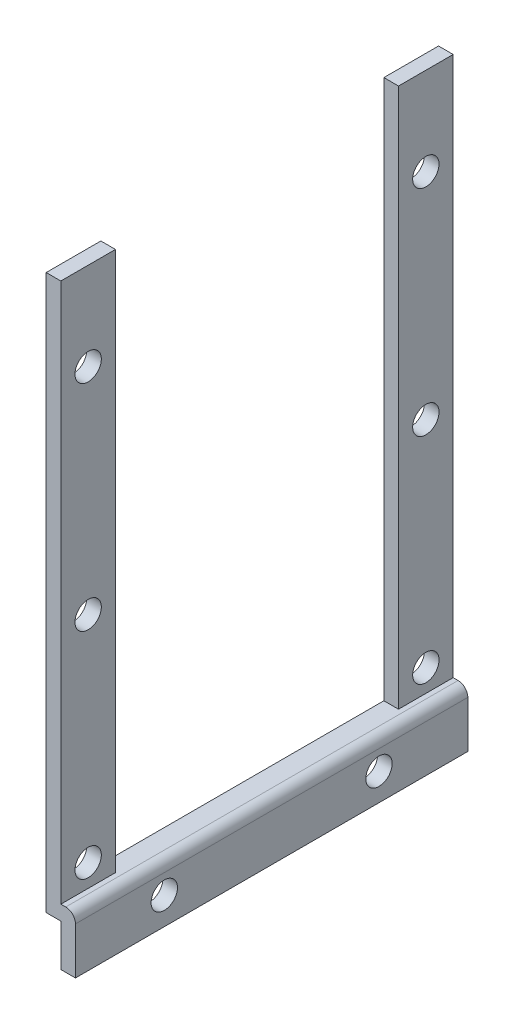
ISO-10303-21;
HEADER;
FILE_DESCRIPTION(('STEP AP214'),'2;1');
FILE_NAME('part.step','',(''),(''),'','','');
FILE_SCHEMA(('AUTOMOTIVE_DESIGN { 1 0 10303 214 1 1 1 1 }'));
ENDSEC;
DATA;
#1=APPLICATION_CONTEXT('core data for automotive mechanical design processes');
#2=APPLICATION_PROTOCOL_DEFINITION('international standard','automotive_design',2000,#1);
#3=PRODUCT_CONTEXT('',#1,'mechanical');
#4=PRODUCT('Part','Part','',(#3));
#5=PRODUCT_RELATED_PRODUCT_CATEGORY('part','',(#4));
#6=PRODUCT_DEFINITION_FORMATION('','',#4);
#7=PRODUCT_DEFINITION_CONTEXT('part definition',#1,'design');
#8=PRODUCT_DEFINITION('design','',#6,#7);
#9=PRODUCT_DEFINITION_SHAPE('','',#8);
#10=(LENGTH_UNIT() NAMED_UNIT(*) SI_UNIT(.MILLI.,.METRE.));
#11=(NAMED_UNIT(*) PLANE_ANGLE_UNIT() SI_UNIT($,.RADIAN.));
#12=(NAMED_UNIT(*) SI_UNIT($,.STERADIAN.) SOLID_ANGLE_UNIT());
#13=UNCERTAINTY_MEASURE_WITH_UNIT(LENGTH_MEASURE(1.E-05),#10,'distance_accuracy_value','');
#14=(GEOMETRIC_REPRESENTATION_CONTEXT(3) GLOBAL_UNCERTAINTY_ASSIGNED_CONTEXT((#13)) GLOBAL_UNIT_ASSIGNED_CONTEXT((#10,
#11,#12)) REPRESENTATION_CONTEXT('',''));
#15=CARTESIAN_POINT('',(0.,0.,0.));
#16=DIRECTION('',(0.,0.,1.));
#17=DIRECTION('',(1.,0.,0.));
#18=AXIS2_PLACEMENT_3D('',#15,#16,#17);
#19=CARTESIAN_POINT('',(-1.5,61.1,-40.2));
#20=DIRECTION('',(0.,1.,0.));
#21=DIRECTION('',(0.,0.,1.));
#22=AXIS2_PLACEMENT_3D('',#19,#20,#21);
#23=PLANE('',#22);
#24=DIRECTION('',(1.,0.,0.));
#25=VECTOR('',#24,1.);
#26=CARTESIAN_POINT('',(-1.50100000000001,61.1,-5.59999999999999));
#27=LINE('',#26,#25);
#28=CARTESIAN_POINT('',(-1.5,61.1,-5.59999999999999));
#29=VERTEX_POINT('',#28);
#30=CARTESIAN_POINT('',(0.,61.1,-5.59999999999999));
#31=VERTEX_POINT('',#30);
#32=EDGE_CURVE('E137',#29,#31,#27,.T.);
#33=ORIENTED_EDGE('',*,*,#32,.F.);
#34=DIRECTION('',(0.,0.,1.));
#35=VECTOR('',#34,1.);
#36=CARTESIAN_POINT('',(-1.5,61.1,-40.2));
#37=LINE('',#36,#35);
#38=CARTESIAN_POINT('',(-1.5,61.1,0.));
#39=VERTEX_POINT('',#38);
#40=EDGE_CURVE('E156',#29,#39,#37,.T.);
#41=ORIENTED_EDGE('',*,*,#40,.T.);
#42=DIRECTION('',(-1.,0.,0.));
#43=VECTOR('',#42,1.);
#44=CARTESIAN_POINT('',(-1.5,61.1,0.));
#45=LINE('',#44,#43);
#46=CARTESIAN_POINT('',(0.,61.1,0.));
#47=VERTEX_POINT('',#46);
#48=EDGE_CURVE('E196',#47,#39,#45,.T.);
#49=ORIENTED_EDGE('',*,*,#48,.F.);
#50=DIRECTION('',(0.,0.,1.));
#51=VECTOR('',#50,1.);
#52=CARTESIAN_POINT('',(0.,61.1,-40.2));
#53=LINE('',#52,#51);
#54=EDGE_CURVE('E164',#31,#47,#53,.T.);
#55=ORIENTED_EDGE('',*,*,#54,.F.);
#56=EDGE_LOOP('',(#33,#41,#49,#55));
#57=FACE_BOUND('',#56,.T.);
#58=ADVANCED_FACE('F35',(#57),#23,.T.);
#59=CARTESIAN_POINT('',(0.,61.1,-40.2));
#60=DIRECTION('',(1.,0.,0.));
#61=DIRECTION('',(0.,1.,0.));
#62=AXIS2_PLACEMENT_3D('',#59,#60,#61);
#63=PLANE('',#62);
#64=CARTESIAN_POINT('',(0.,52.1,-2.79999999999999));
#65=DIRECTION('',(1.,0.,0.));
#66=DIRECTION('',(0.,1.,0.));
#67=AXIS2_PLACEMENT_3D('',#64,#65,#66);
#68=CIRCLE('',#67,1.35);
#69=CARTESIAN_POINT('',(0.,53.45,-2.79999999999999));
#70=VERTEX_POINT('',#69);
#71=EDGE_CURVE('E256',#70,#70,#68,.T.);
#72=ORIENTED_EDGE('',*,*,#71,.F.);
#73=EDGE_LOOP('',(#72));
#74=FACE_BOUND('',#73,.T.);
#75=CARTESIAN_POINT('',(0.,30.1,-2.8));
#76=DIRECTION('',(1.,0.,0.));
#77=DIRECTION('',(0.,1.,0.));
#78=AXIS2_PLACEMENT_3D('',#75,#76,#77);
#79=CIRCLE('',#78,1.35);
#80=CARTESIAN_POINT('',(0.,31.45,-2.8));
#81=VERTEX_POINT('',#80);
#82=EDGE_CURVE('E244',#81,#81,#79,.T.);
#83=ORIENTED_EDGE('',*,*,#82,.F.);
#84=EDGE_LOOP('',(#83));
#85=FACE_BOUND('',#84,.T.);
#86=CARTESIAN_POINT('',(0.,8.1,-2.8));
#87=DIRECTION('',(1.,0.,0.));
#88=DIRECTION('',(0.,1.,0.));
#89=AXIS2_PLACEMENT_3D('',#86,#87,#88);
#90=CIRCLE('',#89,1.35);
#91=CARTESIAN_POINT('',(0.,9.45,-2.8));
#92=VERTEX_POINT('',#91);
#93=EDGE_CURVE('E149',#92,#92,#90,.T.);
#94=ORIENTED_EDGE('',*,*,#93,.F.);
#95=EDGE_LOOP('',(#94));
#96=FACE_BOUND('',#95,.T.);
#97=DIRECTION('',(0.,-1.,0.));
#98=VECTOR('',#97,1.);
#99=CARTESIAN_POINT('',(0.,61.1,-5.59999999999999));
#100=LINE('',#99,#98);
#101=CARTESIAN_POINT('',(0.,5.8,-5.59999999999999));
#102=VERTEX_POINT('',#101);
#103=EDGE_CURVE('E232',#31,#102,#100,.T.);
#104=ORIENTED_EDGE('',*,*,#103,.F.);
#105=ORIENTED_EDGE('',*,*,#54,.T.);
#106=DIRECTION('',(0.,1.,0.));
#107=VECTOR('',#106,1.);
#108=CARTESIAN_POINT('',(0.,61.1,0.));
#109=LINE('',#108,#107);
#110=CARTESIAN_POINT('',(0.,5.8,0.));
#111=VERTEX_POINT('',#110);
#112=EDGE_CURVE('E199',#111,#47,#109,.T.);
#113=ORIENTED_EDGE('',*,*,#112,.F.);
#114=DIRECTION('',(0.,0.,1.));
#115=VECTOR('',#114,1.);
#116=CARTESIAN_POINT('',(0.,5.8,-40.2));
#117=LINE('',#116,#115);
#118=EDGE_CURVE('E168',#102,#111,#117,.T.);
#119=ORIENTED_EDGE('',*,*,#118,.F.);
#120=EDGE_LOOP('',(#104,#105,#113,#119));
#121=FACE_BOUND('',#120,.T.);
#122=ADVANCED_FACE('F321',(#74,#85,#96,#121),#63,.T.);
#123=CARTESIAN_POINT('',(1.5,0.,-40.2));
#124=DIRECTION('',(0.,-1.,0.));
#125=DIRECTION('',(1.,0.,0.));
#126=AXIS2_PLACEMENT_3D('',#123,#124,#125);
#127=PLANE('',#126);
#128=DIRECTION('',(1.,0.,0.));
#129=VECTOR('',#128,1.);
#130=CARTESIAN_POINT('',(1.5,0.,0.));
#131=LINE('',#130,#129);
#132=CARTESIAN_POINT('',(0.,0.,0.));
#133=VERTEX_POINT('',#132);
#134=CARTESIAN_POINT('',(1.5,0.,0.));
#135=VERTEX_POINT('',#134);
#136=EDGE_CURVE('E206',#133,#135,#131,.T.);
#137=ORIENTED_EDGE('',*,*,#136,.F.);
#138=DIRECTION('',(0.,0.,1.));
#139=VECTOR('',#138,1.);
#140=CARTESIAN_POINT('',(0.,0.,-40.2));
#141=LINE('',#140,#139);
#142=CARTESIAN_POINT('',(0.,0.,-40.2));
#143=VERTEX_POINT('',#142);
#144=EDGE_CURVE('E175',#143,#133,#141,.T.);
#145=ORIENTED_EDGE('',*,*,#144,.F.);
#146=DIRECTION('',(1.,0.,0.));
#147=VECTOR('',#146,1.);
#148=CARTESIAN_POINT('',(1.5,0.,-40.2));
#149=LINE('',#148,#147);
#150=CARTESIAN_POINT('',(1.5,0.,-40.2));
#151=VERTEX_POINT('',#150);
#152=EDGE_CURVE('E189',#143,#151,#149,.T.);
#153=ORIENTED_EDGE('',*,*,#152,.T.);
#154=DIRECTION('',(0.,0.,1.));
#155=VECTOR('',#154,1.);
#156=CARTESIAN_POINT('',(1.5,0.,-40.2));
#157=LINE('',#156,#155);
#158=EDGE_CURVE('E169',#151,#135,#157,.T.);
#159=ORIENTED_EDGE('',*,*,#158,.T.);
#160=EDGE_LOOP('',(#137,#145,#153,#159));
#161=FACE_BOUND('',#160,.T.);
#162=ADVANCED_FACE('F323',(#161),#127,.T.);
#163=CARTESIAN_POINT('',(0.,0.,-40.2));
#164=DIRECTION('',(-1.,0.,0.));
#165=DIRECTION('',(0.,0.,1.));
#166=AXIS2_PLACEMENT_3D('',#163,#164,#165);
#167=PLANE('',#166);
#168=CARTESIAN_POINT('',(0.,2.8,-31.1));
#169=DIRECTION('',(-1.,0.,0.));
#170=DIRECTION('',(0.,0.,1.));
#171=AXIS2_PLACEMENT_3D('',#168,#169,#170);
#172=CIRCLE('',#171,1.35);
#173=CARTESIAN_POINT('',(0.,2.8,-29.75));
#174=VERTEX_POINT('',#173);
#175=EDGE_CURVE('E277',#174,#174,#172,.F.);
#176=ORIENTED_EDGE('',*,*,#175,.T.);
#177=EDGE_LOOP('',(#176));
#178=FACE_BOUND('',#177,.T.);
#179=CARTESIAN_POINT('',(0.,2.8,-9.1));
#180=DIRECTION('',(-1.,0.,0.));
#181=DIRECTION('',(0.,0.,1.));
#182=AXIS2_PLACEMENT_3D('',#179,#180,#181);
#183=CIRCLE('',#182,1.35);
#184=CARTESIAN_POINT('',(0.,2.8,-7.75));
#185=VERTEX_POINT('',#184);
#186=EDGE_CURVE('E271',#185,#185,#183,.F.);
#187=ORIENTED_EDGE('',*,*,#186,.T.);
#188=EDGE_LOOP('',(#187));
#189=FACE_BOUND('',#188,.T.);
#190=DIRECTION('',(0.,-1.,0.));
#191=VECTOR('',#190,1.);
#192=CARTESIAN_POINT('',(0.,0.,0.));
#193=LINE('',#192,#191);
#194=CARTESIAN_POINT('',(0.,4.3,0.));
#195=VERTEX_POINT('',#194);
#196=EDGE_CURVE('E186',#195,#133,#193,.T.);
#197=ORIENTED_EDGE('',*,*,#196,.F.);
#198=DIRECTION('',(0.,0.,1.));
#199=VECTOR('',#198,1.);
#200=CARTESIAN_POINT('',(0.,4.3,-40.2));
#201=LINE('',#200,#199);
#202=CARTESIAN_POINT('',(0.,4.3,-40.2));
#203=VERTEX_POINT('',#202);
#204=EDGE_CURVE('E158',#203,#195,#201,.T.);
#205=ORIENTED_EDGE('',*,*,#204,.F.);
#206=DIRECTION('',(0.,-1.,0.));
#207=VECTOR('',#206,1.);
#208=CARTESIAN_POINT('',(0.,0.,-40.2));
#209=LINE('',#208,#207);
#210=EDGE_CURVE('E171',#203,#143,#209,.T.);
#211=ORIENTED_EDGE('',*,*,#210,.T.);
#212=ORIENTED_EDGE('',*,*,#144,.T.);
#213=EDGE_LOOP('',(#197,#205,#211,#212));
#214=FACE_BOUND('',#213,.T.);
#215=ADVANCED_FACE('F330',(#178,#189,#214),#167,.T.);
#216=CARTESIAN_POINT('',(0.,4.3,-40.2));
#217=DIRECTION('',(0.,-1.,0.));
#218=DIRECTION('',(0.,0.,-1.));
#219=AXIS2_PLACEMENT_3D('',#216,#217,#218);
#220=PLANE('',#219);
#221=DIRECTION('',(1.,0.,0.));
#222=VECTOR('',#221,1.);
#223=CARTESIAN_POINT('',(0.,4.3,0.));
#224=LINE('',#223,#222);
#225=CARTESIAN_POINT('',(-1.5,4.3,0.));
#226=VERTEX_POINT('',#225);
#227=EDGE_CURVE('E190',#226,#195,#224,.T.);
#228=ORIENTED_EDGE('',*,*,#227,.F.);
#229=DIRECTION('',(0.,0.,1.));
#230=VECTOR('',#229,1.);
#231=CARTESIAN_POINT('',(-1.5,4.3,-40.2));
#232=LINE('',#231,#230);
#233=CARTESIAN_POINT('',(-1.5,4.3,-40.2));
#234=VERTEX_POINT('',#233);
#235=EDGE_CURVE('E155',#234,#226,#232,.T.);
#236=ORIENTED_EDGE('',*,*,#235,.F.);
#237=DIRECTION('',(1.,0.,0.));
#238=VECTOR('',#237,1.);
#239=CARTESIAN_POINT('',(0.,4.3,-40.2));
#240=LINE('',#239,#238);
#241=EDGE_CURVE('E210',#234,#203,#240,.T.);
#242=ORIENTED_EDGE('',*,*,#241,.T.);
#243=ORIENTED_EDGE('',*,*,#204,.T.);
#244=EDGE_LOOP('',(#228,#236,#242,#243));
#245=FACE_BOUND('',#244,.T.);
#246=ADVANCED_FACE('F307',(#245),#220,.T.);
#247=CARTESIAN_POINT('',(-1.5,4.3,-40.2));
#248=DIRECTION('',(-1.,0.,0.));
#249=DIRECTION('',(0.,0.,1.));
#250=AXIS2_PLACEMENT_3D('',#247,#248,#249);
#251=PLANE('',#250);
#252=CARTESIAN_POINT('',(-1.5,52.1,-37.4));
#253=DIRECTION('',(-1.,0.,0.));
#254=DIRECTION('',(0.,0.,1.));
#255=AXIS2_PLACEMENT_3D('',#252,#253,#254);
#256=CIRCLE('',#255,1.35);
#257=CARTESIAN_POINT('',(-1.5,52.1,-36.05));
#258=VERTEX_POINT('',#257);
#259=EDGE_CURVE('E265',#258,#258,#256,.F.);
#260=ORIENTED_EDGE('',*,*,#259,.T.);
#261=EDGE_LOOP('',(#260));
#262=FACE_BOUND('',#261,.T.);
#263=CARTESIAN_POINT('',(-1.5,52.1,-2.79999999999999));
#264=DIRECTION('',(-1.,0.,0.));
#265=DIRECTION('',(0.,0.,1.));
#266=AXIS2_PLACEMENT_3D('',#263,#264,#265);
#267=CIRCLE('',#266,1.35);
#268=CARTESIAN_POINT('',(-1.5,52.1,-1.45));
#269=VERTEX_POINT('',#268);
#270=EDGE_CURVE('E259',#269,#269,#267,.F.);
#271=ORIENTED_EDGE('',*,*,#270,.T.);
#272=EDGE_LOOP('',(#271));
#273=FACE_BOUND('',#272,.T.);
#274=CARTESIAN_POINT('',(-1.5,30.1,-37.4));
#275=DIRECTION('',(-1.,0.,0.));
#276=DIRECTION('',(0.,0.,1.));
#277=AXIS2_PLACEMENT_3D('',#274,#275,#276);
#278=CIRCLE('',#277,1.35);
#279=CARTESIAN_POINT('',(-1.5,30.1,-36.05));
#280=VERTEX_POINT('',#279);
#281=EDGE_CURVE('E253',#280,#280,#278,.F.);
#282=ORIENTED_EDGE('',*,*,#281,.T.);
#283=EDGE_LOOP('',(#282));
#284=FACE_BOUND('',#283,.T.);
#285=CARTESIAN_POINT('',(-1.5,30.1,-2.8));
#286=DIRECTION('',(-1.,0.,0.));
#287=DIRECTION('',(0.,0.,1.));
#288=AXIS2_PLACEMENT_3D('',#285,#286,#287);
#289=CIRCLE('',#288,1.35);
#290=CARTESIAN_POINT('',(-1.5,30.1,-1.45));
#291=VERTEX_POINT('',#290);
#292=EDGE_CURVE('E247',#291,#291,#289,.F.);
#293=ORIENTED_EDGE('',*,*,#292,.T.);
#294=EDGE_LOOP('',(#293));
#295=FACE_BOUND('',#294,.T.);
#296=CARTESIAN_POINT('',(-1.5,8.1,-37.4));
#297=DIRECTION('',(-1.,0.,0.));
#298=DIRECTION('',(0.,0.,1.));
#299=AXIS2_PLACEMENT_3D('',#296,#297,#298);
#300=CIRCLE('',#299,1.35);
#301=CARTESIAN_POINT('',(-1.5,8.1,-36.05));
#302=VERTEX_POINT('',#301);
#303=EDGE_CURVE('E241',#302,#302,#300,.F.);
#304=ORIENTED_EDGE('',*,*,#303,.T.);
#305=EDGE_LOOP('',(#304));
#306=FACE_BOUND('',#305,.T.);
#307=CARTESIAN_POINT('',(-1.5,8.1,-2.8));
#308=DIRECTION('',(-1.,0.,0.));
#309=DIRECTION('',(0.,0.,1.));
#310=AXIS2_PLACEMENT_3D('',#307,#308,#309);
#311=CIRCLE('',#310,1.35);
#312=CARTESIAN_POINT('',(-1.5,8.1,-1.45));
#313=VERTEX_POINT('',#312);
#314=EDGE_CURVE('E235',#313,#313,#311,.F.);
#315=ORIENTED_EDGE('',*,*,#314,.T.);
#316=EDGE_LOOP('',(#315));
#317=FACE_BOUND('',#316,.T.);
#318=DIRECTION('',(0.,-1.,0.));
#319=VECTOR('',#318,1.);
#320=CARTESIAN_POINT('',(-1.5,61.1,-5.59999999999999));
#321=LINE('',#320,#319);
#322=CARTESIAN_POINT('',(-1.5,5.8,-5.6));
#323=VERTEX_POINT('',#322);
#324=EDGE_CURVE('E148',#29,#323,#321,.T.);
#325=ORIENTED_EDGE('',*,*,#324,.T.);
#326=DIRECTION('',(0.,0.,-1.));
#327=VECTOR('',#326,1.);
#328=CARTESIAN_POINT('',(-1.5,5.8,-5.6));
#329=LINE('',#328,#327);
#330=CARTESIAN_POINT('',(-1.5,5.8,-34.6));
#331=VERTEX_POINT('',#330);
#332=EDGE_CURVE('E147',#323,#331,#329,.T.);
#333=ORIENTED_EDGE('',*,*,#332,.T.);
#334=DIRECTION('',(0.,1.,0.));
#335=VECTOR('',#334,1.);
#336=CARTESIAN_POINT('',(-1.5,61.1,-34.6));
#337=LINE('',#336,#335);
#338=CARTESIAN_POINT('',(-1.5,61.1,-34.6));
#339=VERTEX_POINT('',#338);
#340=EDGE_CURVE('E130',#331,#339,#337,.T.);
#341=ORIENTED_EDGE('',*,*,#340,.T.);
#342=CARTESIAN_POINT('',(-1.5,61.1,-40.2));
#343=VERTEX_POINT('',#342);
#344=EDGE_CURVE('E145',#343,#339,#37,.T.);
#345=ORIENTED_EDGE('',*,*,#344,.F.);
#346=DIRECTION('',(0.,-1.,0.));
#347=VECTOR('',#346,1.);
#348=CARTESIAN_POINT('',(-1.5,4.3,-40.2));
#349=LINE('',#348,#347);
#350=EDGE_CURVE('E213',#343,#234,#349,.T.);
#351=ORIENTED_EDGE('',*,*,#350,.T.);
#352=ORIENTED_EDGE('',*,*,#235,.T.);
#353=DIRECTION('',(0.,-1.,0.));
#354=VECTOR('',#353,1.);
#355=CARTESIAN_POINT('',(-1.5,4.3,0.));
#356=LINE('',#355,#354);
#357=EDGE_CURVE('E193',#39,#226,#356,.T.);
#358=ORIENTED_EDGE('',*,*,#357,.F.);
#359=ORIENTED_EDGE('',*,*,#40,.F.);
#360=EDGE_LOOP('',(#325,#333,#341,#345,#351,#352,#358,#359));
#361=FACE_BOUND('',#360,.T.);
#362=ADVANCED_FACE('F143',(#262,#273,#284,#295,#306,#317,#361),#251,.T.);
#363=DIRECTION('',(1.,0.,0.));
#364=VECTOR('',#363,1.);
#365=CARTESIAN_POINT('',(-1.50100000000001,61.1,-34.6));
#366=LINE('',#365,#364);
#367=CARTESIAN_POINT('',(0.,61.1,-34.6));
#368=VERTEX_POINT('',#367);
#369=EDGE_CURVE('E127',#339,#368,#366,.T.);
#370=ORIENTED_EDGE('',*,*,#369,.T.);
#371=CARTESIAN_POINT('',(0.,61.1,-40.2));
#372=VERTEX_POINT('',#371);
#373=EDGE_CURVE('E160',#372,#368,#53,.T.);
#374=ORIENTED_EDGE('',*,*,#373,.F.);
#375=DIRECTION('',(-1.,0.,0.));
#376=VECTOR('',#375,1.);
#377=CARTESIAN_POINT('',(-1.5,61.1,-40.2));
#378=LINE('',#377,#376);
#379=EDGE_CURVE('E154',#372,#343,#378,.T.);
#380=ORIENTED_EDGE('',*,*,#379,.T.);
#381=ORIENTED_EDGE('',*,*,#344,.T.);
#382=EDGE_LOOP('',(#370,#374,#380,#381));
#383=FACE_BOUND('',#382,.T.);
#384=ADVANCED_FACE('F152',(#383),#23,.T.);
#385=CARTESIAN_POINT('',(0.,52.1,-37.4));
#386=DIRECTION('',(1.,0.,0.));
#387=DIRECTION('',(0.,1.,0.));
#388=AXIS2_PLACEMENT_3D('',#385,#386,#387);
#389=CIRCLE('',#388,1.35);
#390=CARTESIAN_POINT('',(0.,53.45,-37.4));
#391=VERTEX_POINT('',#390);
#392=EDGE_CURVE('E262',#391,#391,#389,.T.);
#393=ORIENTED_EDGE('',*,*,#392,.F.);
#394=EDGE_LOOP('',(#393));
#395=FACE_BOUND('',#394,.T.);
#396=CARTESIAN_POINT('',(0.,30.1,-37.4));
#397=DIRECTION('',(1.,0.,0.));
#398=DIRECTION('',(0.,1.,0.));
#399=AXIS2_PLACEMENT_3D('',#396,#397,#398);
#400=CIRCLE('',#399,1.35);
#401=CARTESIAN_POINT('',(0.,31.45,-37.4));
#402=VERTEX_POINT('',#401);
#403=EDGE_CURVE('E250',#402,#402,#400,.T.);
#404=ORIENTED_EDGE('',*,*,#403,.F.);
#405=EDGE_LOOP('',(#404));
#406=FACE_BOUND('',#405,.T.);
#407=CARTESIAN_POINT('',(0.,8.1,-37.4));
#408=DIRECTION('',(1.,0.,0.));
#409=DIRECTION('',(0.,1.,0.));
#410=AXIS2_PLACEMENT_3D('',#407,#408,#409);
#411=CIRCLE('',#410,1.35);
#412=CARTESIAN_POINT('',(0.,9.45,-37.4));
#413=VERTEX_POINT('',#412);
#414=EDGE_CURVE('E238',#413,#413,#411,.T.);
#415=ORIENTED_EDGE('',*,*,#414,.F.);
#416=EDGE_LOOP('',(#415));
#417=FACE_BOUND('',#416,.T.);
#418=DIRECTION('',(0.,1.,0.));
#419=VECTOR('',#418,1.);
#420=CARTESIAN_POINT('',(0.,61.1,-34.6));
#421=LINE('',#420,#419);
#422=CARTESIAN_POINT('',(0.,5.8,-34.6));
#423=VERTEX_POINT('',#422);
#424=EDGE_CURVE('E133',#423,#368,#421,.T.);
#425=ORIENTED_EDGE('',*,*,#424,.F.);
#426=CARTESIAN_POINT('',(0.,5.8,-40.2));
#427=VERTEX_POINT('',#426);
#428=EDGE_CURVE('E165',#427,#423,#117,.T.);
#429=ORIENTED_EDGE('',*,*,#428,.F.);
#430=DIRECTION('',(0.,1.,0.));
#431=VECTOR('',#430,1.);
#432=CARTESIAN_POINT('',(0.,61.1,-40.2));
#433=LINE('',#432,#431);
#434=EDGE_CURVE('E216',#427,#372,#433,.T.);
#435=ORIENTED_EDGE('',*,*,#434,.T.);
#436=ORIENTED_EDGE('',*,*,#373,.T.);
#437=EDGE_LOOP('',(#425,#429,#435,#436));
#438=FACE_BOUND('',#437,.T.);
#439=ADVANCED_FACE('F300',(#395,#406,#417,#438),#63,.T.);
#440=CARTESIAN_POINT('',(0.,5.8,-40.2));
#441=DIRECTION('',(0.,1.,0.));
#442=DIRECTION('',(0.,0.,1.));
#443=AXIS2_PLACEMENT_3D('',#440,#441,#442);
#444=PLANE('',#443);
#445=DIRECTION('',(-1.,0.,0.));
#446=VECTOR('',#445,1.);
#447=CARTESIAN_POINT('',(0.,5.8,0.));
#448=LINE('',#447,#446);
#449=CARTESIAN_POINT('',(0.5,5.8,0.));
#450=VERTEX_POINT('',#449);
#451=EDGE_CURVE('E202',#450,#111,#448,.T.);
#452=ORIENTED_EDGE('',*,*,#451,.F.);
#453=DIRECTION('',(0.,0.,1.));
#454=VECTOR('',#453,1.);
#455=CARTESIAN_POINT('',(0.5,5.8,-40.2));
#456=LINE('',#455,#454);
#457=CARTESIAN_POINT('',(0.5,5.8,-40.2));
#458=VERTEX_POINT('',#457);
#459=EDGE_CURVE('E43',#450,#458,#456,.F.);
#460=ORIENTED_EDGE('',*,*,#459,.T.);
#461=DIRECTION('',(-1.,0.,0.));
#462=VECTOR('',#461,1.);
#463=CARTESIAN_POINT('',(0.,5.8,-40.2));
#464=LINE('',#463,#462);
#465=EDGE_CURVE('E219',#458,#427,#464,.T.);
#466=ORIENTED_EDGE('',*,*,#465,.T.);
#467=ORIENTED_EDGE('',*,*,#428,.T.);
#468=DIRECTION('',(1.,0.,0.));
#469=VECTOR('',#468,1.);
#470=CARTESIAN_POINT('',(-1.501,5.8,-34.6));
#471=LINE('',#470,#469);
#472=EDGE_CURVE('E138',#331,#423,#471,.T.);
#473=ORIENTED_EDGE('',*,*,#472,.F.);
#474=ORIENTED_EDGE('',*,*,#332,.F.);
#475=DIRECTION('',(1.,0.,0.));
#476=VECTOR('',#475,1.);
#477=CARTESIAN_POINT('',(-1.501,5.8,-5.6));
#478=LINE('',#477,#476);
#479=EDGE_CURVE('E226',#323,#102,#478,.T.);
#480=ORIENTED_EDGE('',*,*,#479,.T.);
#481=ORIENTED_EDGE('',*,*,#118,.T.);
#482=EDGE_LOOP('',(#452,#460,#466,#467,#473,#474,#480,#481));
#483=FACE_BOUND('',#482,.T.);
#484=ADVANCED_FACE('F289',(#483),#444,.T.);
#485=CARTESIAN_POINT('',(1.5,5.8,-40.2));
#486=DIRECTION('',(1.,0.,0.));
#487=DIRECTION('',(0.,1.,0.));
#488=AXIS2_PLACEMENT_3D('',#485,#486,#487);
#489=PLANE('',#488);
#490=CARTESIAN_POINT('',(1.5,2.8,-31.1));
#491=DIRECTION('',(1.,0.,0.));
#492=DIRECTION('',(0.,1.,0.));
#493=AXIS2_PLACEMENT_3D('',#490,#491,#492);
#494=CIRCLE('',#493,1.35);
#495=CARTESIAN_POINT('',(1.5,4.15,-31.1));
#496=VERTEX_POINT('',#495);
#497=EDGE_CURVE('E274',#496,#496,#494,.T.);
#498=ORIENTED_EDGE('',*,*,#497,.F.);
#499=EDGE_LOOP('',(#498));
#500=FACE_BOUND('',#499,.T.);
#501=CARTESIAN_POINT('',(1.5,2.8,-9.1));
#502=DIRECTION('',(1.,0.,0.));
#503=DIRECTION('',(0.,1.,0.));
#504=AXIS2_PLACEMENT_3D('',#501,#502,#503);
#505=CIRCLE('',#504,1.35);
#506=CARTESIAN_POINT('',(1.5,4.15,-9.1));
#507=VERTEX_POINT('',#506);
#508=EDGE_CURVE('E268',#507,#507,#505,.T.);
#509=ORIENTED_EDGE('',*,*,#508,.F.);
#510=EDGE_LOOP('',(#509));
#511=FACE_BOUND('',#510,.T.);
#512=DIRECTION('',(0.,1.,0.));
#513=VECTOR('',#512,1.);
#514=CARTESIAN_POINT('',(1.5,5.8,-40.2));
#515=LINE('',#514,#513);
#516=CARTESIAN_POINT('',(1.5,4.8,-40.2));
#517=VERTEX_POINT('',#516);
#518=EDGE_CURVE('E221',#151,#517,#515,.T.);
#519=ORIENTED_EDGE('',*,*,#518,.T.);
#520=DIRECTION('',(0.,0.,1.));
#521=VECTOR('',#520,1.);
#522=CARTESIAN_POINT('',(1.5,4.8,-40.2));
#523=LINE('',#522,#521);
#524=CARTESIAN_POINT('',(1.5,4.8,0.));
#525=VERTEX_POINT('',#524);
#526=EDGE_CURVE('E172',#517,#525,#523,.T.);
#527=ORIENTED_EDGE('',*,*,#526,.T.);
#528=DIRECTION('',(0.,1.,0.));
#529=VECTOR('',#528,1.);
#530=CARTESIAN_POINT('',(1.5,5.8,0.));
#531=LINE('',#530,#529);
#532=EDGE_CURVE('E204',#135,#525,#531,.T.);
#533=ORIENTED_EDGE('',*,*,#532,.F.);
#534=ORIENTED_EDGE('',*,*,#158,.F.);
#535=EDGE_LOOP('',(#519,#527,#533,#534));
#536=FACE_BOUND('',#535,.T.);
#537=ADVANCED_FACE('F285',(#500,#511,#536),#489,.T.);
#538=CARTESIAN_POINT('',(0.,0.,-40.2));
#539=DIRECTION('',(0.,0.,-1.));
#540=DIRECTION('',(-1.,0.,0.));
#541=AXIS2_PLACEMENT_3D('',#538,#539,#540);
#542=PLANE('',#541);
#543=ORIENTED_EDGE('',*,*,#465,.F.);
#544=CARTESIAN_POINT('',(0.5,4.8,-40.2));
#545=DIRECTION('',(0.,0.,-1.));
#546=DIRECTION('',(-1.,0.,0.));
#547=AXIS2_PLACEMENT_3D('',#544,#545,#546);
#548=CIRCLE('',#547,1.);
#549=EDGE_CURVE('E11',#458,#517,#548,.T.);
#550=ORIENTED_EDGE('',*,*,#549,.T.);
#551=ORIENTED_EDGE('',*,*,#518,.F.);
#552=ORIENTED_EDGE('',*,*,#152,.F.);
#553=ORIENTED_EDGE('',*,*,#210,.F.);
#554=ORIENTED_EDGE('',*,*,#241,.F.);
#555=ORIENTED_EDGE('',*,*,#350,.F.);
#556=ORIENTED_EDGE('',*,*,#379,.F.);
#557=ORIENTED_EDGE('',*,*,#434,.F.);
#558=EDGE_LOOP('',(#543,#550,#551,#552,#553,#554,#555,#556,#557));
#559=FACE_BOUND('',#558,.T.);
#560=ADVANCED_FACE('F288',(#559),#542,.T.);
#561=CARTESIAN_POINT('',(0.,0.,0.));
#562=DIRECTION('',(0.,0.,-1.));
#563=DIRECTION('',(-1.,0.,0.));
#564=AXIS2_PLACEMENT_3D('',#561,#562,#563);
#565=PLANE('',#564);
#566=ORIENTED_EDGE('',*,*,#532,.T.);
#567=CARTESIAN_POINT('',(0.5,4.8,0.));
#568=DIRECTION('',(0.,0.,-1.));
#569=DIRECTION('',(-1.,0.,0.));
#570=AXIS2_PLACEMENT_3D('',#567,#568,#569);
#571=CIRCLE('',#570,1.);
#572=EDGE_CURVE('E57',#525,#450,#571,.F.);
#573=ORIENTED_EDGE('',*,*,#572,.T.);
#574=ORIENTED_EDGE('',*,*,#451,.T.);
#575=ORIENTED_EDGE('',*,*,#112,.T.);
#576=ORIENTED_EDGE('',*,*,#48,.T.);
#577=ORIENTED_EDGE('',*,*,#357,.T.);
#578=ORIENTED_EDGE('',*,*,#227,.T.);
#579=ORIENTED_EDGE('',*,*,#196,.T.);
#580=ORIENTED_EDGE('',*,*,#136,.T.);
#581=EDGE_LOOP('',(#566,#573,#574,#575,#576,#577,#578,#579,#580));
#582=FACE_BOUND('',#581,.T.);
#583=ADVANCED_FACE('F308',(#582),#565,.F.);
#584=CARTESIAN_POINT('',(-1.50100000000001,61.1,-5.59999999999999));
#585=DIRECTION('',(0.,0.,1.));
#586=DIRECTION('',(0.,-1.,0.));
#587=AXIS2_PLACEMENT_3D('',#584,#585,#586);
#588=PLANE('',#587);
#589=ORIENTED_EDGE('',*,*,#32,.T.);
#590=ORIENTED_EDGE('',*,*,#103,.T.);
#591=ORIENTED_EDGE('',*,*,#479,.F.);
#592=ORIENTED_EDGE('',*,*,#324,.F.);
#593=EDGE_LOOP('',(#589,#590,#591,#592));
#594=FACE_BOUND('',#593,.T.);
#595=ADVANCED_FACE('F316',(#594),#588,.F.);
#596=CARTESIAN_POINT('',(-1.50100000000001,61.1,-34.6));
#597=DIRECTION('',(0.,0.,-1.));
#598=DIRECTION('',(0.,1.,0.));
#599=AXIS2_PLACEMENT_3D('',#596,#597,#598);
#600=PLANE('',#599);
#601=ORIENTED_EDGE('',*,*,#472,.T.);
#602=ORIENTED_EDGE('',*,*,#424,.T.);
#603=ORIENTED_EDGE('',*,*,#369,.F.);
#604=ORIENTED_EDGE('',*,*,#340,.F.);
#605=EDGE_LOOP('',(#601,#602,#603,#604));
#606=FACE_BOUND('',#605,.T.);
#607=ADVANCED_FACE('F129',(#606),#600,.F.);
#608=CARTESIAN_POINT('',(-1.501,8.1,-2.8));
#609=DIRECTION('',(1.,0.,0.));
#610=DIRECTION('',(0.,1.,0.));
#611=AXIS2_PLACEMENT_3D('',#608,#609,#610);
#612=CYLINDRICAL_SURFACE('',#611,1.35);
#613=ORIENTED_EDGE('',*,*,#314,.F.);
#614=EDGE_LOOP('',(#613));
#615=FACE_BOUND('',#614,.T.);
#616=ORIENTED_EDGE('',*,*,#93,.T.);
#617=EDGE_LOOP('',(#616));
#618=FACE_BOUND('',#617,.T.);
#619=ADVANCED_FACE('F351',(#615,#618),#612,.F.);
#620=CARTESIAN_POINT('',(-1.501,8.1,-37.4));
#621=DIRECTION('',(1.,0.,0.));
#622=DIRECTION('',(0.,1.,0.));
#623=AXIS2_PLACEMENT_3D('',#620,#621,#622);
#624=CYLINDRICAL_SURFACE('',#623,1.35);
#625=ORIENTED_EDGE('',*,*,#303,.F.);
#626=EDGE_LOOP('',(#625));
#627=FACE_BOUND('',#626,.T.);
#628=ORIENTED_EDGE('',*,*,#414,.T.);
#629=EDGE_LOOP('',(#628));
#630=FACE_BOUND('',#629,.T.);
#631=ADVANCED_FACE('F348',(#627,#630),#624,.F.);
#632=CARTESIAN_POINT('',(-1.501,30.1,-2.8));
#633=DIRECTION('',(1.,0.,0.));
#634=DIRECTION('',(0.,1.,0.));
#635=AXIS2_PLACEMENT_3D('',#632,#633,#634);
#636=CYLINDRICAL_SURFACE('',#635,1.35);
#637=ORIENTED_EDGE('',*,*,#292,.F.);
#638=EDGE_LOOP('',(#637));
#639=FACE_BOUND('',#638,.T.);
#640=ORIENTED_EDGE('',*,*,#82,.T.);
#641=EDGE_LOOP('',(#640));
#642=FACE_BOUND('',#641,.T.);
#643=ADVANCED_FACE('F350',(#639,#642),#636,.F.);
#644=CARTESIAN_POINT('',(-1.501,30.1,-37.4));
#645=DIRECTION('',(1.,0.,0.));
#646=DIRECTION('',(0.,1.,0.));
#647=AXIS2_PLACEMENT_3D('',#644,#645,#646);
#648=CYLINDRICAL_SURFACE('',#647,1.35);
#649=ORIENTED_EDGE('',*,*,#281,.F.);
#650=EDGE_LOOP('',(#649));
#651=FACE_BOUND('',#650,.T.);
#652=ORIENTED_EDGE('',*,*,#403,.T.);
#653=EDGE_LOOP('',(#652));
#654=FACE_BOUND('',#653,.T.);
#655=ADVANCED_FACE('F358',(#651,#654),#648,.F.);
#656=CARTESIAN_POINT('',(-1.50100000000001,52.1,-2.79999999999999));
#657=DIRECTION('',(1.,0.,0.));
#658=DIRECTION('',(0.,1.,0.));
#659=AXIS2_PLACEMENT_3D('',#656,#657,#658);
#660=CYLINDRICAL_SURFACE('',#659,1.35);
#661=ORIENTED_EDGE('',*,*,#270,.F.);
#662=EDGE_LOOP('',(#661));
#663=FACE_BOUND('',#662,.T.);
#664=ORIENTED_EDGE('',*,*,#71,.T.);
#665=EDGE_LOOP('',(#664));
#666=FACE_BOUND('',#665,.T.);
#667=ADVANCED_FACE('F401',(#663,#666),#660,.F.);
#668=CARTESIAN_POINT('',(-1.50100000000001,52.1,-37.4));
#669=DIRECTION('',(1.,0.,0.));
#670=DIRECTION('',(0.,1.,0.));
#671=AXIS2_PLACEMENT_3D('',#668,#669,#670);
#672=CYLINDRICAL_SURFACE('',#671,1.35);
#673=ORIENTED_EDGE('',*,*,#259,.F.);
#674=EDGE_LOOP('',(#673));
#675=FACE_BOUND('',#674,.T.);
#676=ORIENTED_EDGE('',*,*,#392,.T.);
#677=EDGE_LOOP('',(#676));
#678=FACE_BOUND('',#677,.T.);
#679=ADVANCED_FACE('F405',(#675,#678),#672,.F.);
#680=CARTESIAN_POINT('',(0.5,4.8,-40.2));
#681=DIRECTION('',(0.,0.,1.));
#682=DIRECTION('',(1.,0.,0.));
#683=AXIS2_PLACEMENT_3D('',#680,#681,#682);
#684=CYLINDRICAL_SURFACE('',#683,1.);
#685=ORIENTED_EDGE('',*,*,#549,.F.);
#686=ORIENTED_EDGE('',*,*,#459,.F.);
#687=ORIENTED_EDGE('',*,*,#572,.F.);
#688=ORIENTED_EDGE('',*,*,#526,.F.);
#689=EDGE_LOOP('',(#685,#686,#687,#688));
#690=FACE_BOUND('',#689,.T.);
#691=ADVANCED_FACE('F37',(#690),#684,.T.);
#692=CARTESIAN_POINT('',(-1.501,2.8,-9.1));
#693=DIRECTION('',(1.,0.,0.));
#694=DIRECTION('',(0.,1.,0.));
#695=AXIS2_PLACEMENT_3D('',#692,#693,#694);
#696=CYLINDRICAL_SURFACE('',#695,1.35);
#697=ORIENTED_EDGE('',*,*,#186,.F.);
#698=EDGE_LOOP('',(#697));
#699=FACE_BOUND('',#698,.T.);
#700=ORIENTED_EDGE('',*,*,#508,.T.);
#701=EDGE_LOOP('',(#700));
#702=FACE_BOUND('',#701,.T.);
#703=ADVANCED_FACE('F412',(#699,#702),#696,.F.);
#704=CARTESIAN_POINT('',(-1.501,2.8,-31.1));
#705=DIRECTION('',(1.,0.,0.));
#706=DIRECTION('',(0.,1.,0.));
#707=AXIS2_PLACEMENT_3D('',#704,#705,#706);
#708=CYLINDRICAL_SURFACE('',#707,1.35);
#709=ORIENTED_EDGE('',*,*,#175,.F.);
#710=EDGE_LOOP('',(#709));
#711=FACE_BOUND('',#710,.T.);
#712=ORIENTED_EDGE('',*,*,#497,.T.);
#713=EDGE_LOOP('',(#712));
#714=FACE_BOUND('',#713,.T.);
#715=ADVANCED_FACE('F283',(#711,#714),#708,.F.);
#716=CLOSED_SHELL('',(#58,#122,#162,#215,#246,#362,#384,#439,#484,#537,#560,#583,#595,#607,#619,
#631,#643,#655,#667,#679,#691,#703,#715));
#717=MANIFOLD_SOLID_BREP('B2',#716);
#718=ADVANCED_BREP_SHAPE_REPRESENTATION('',(#18,#717),#14);
#719=SHAPE_DEFINITION_REPRESENTATION(#9,#718);
ENDSEC;
END-ISO-10303-21;
